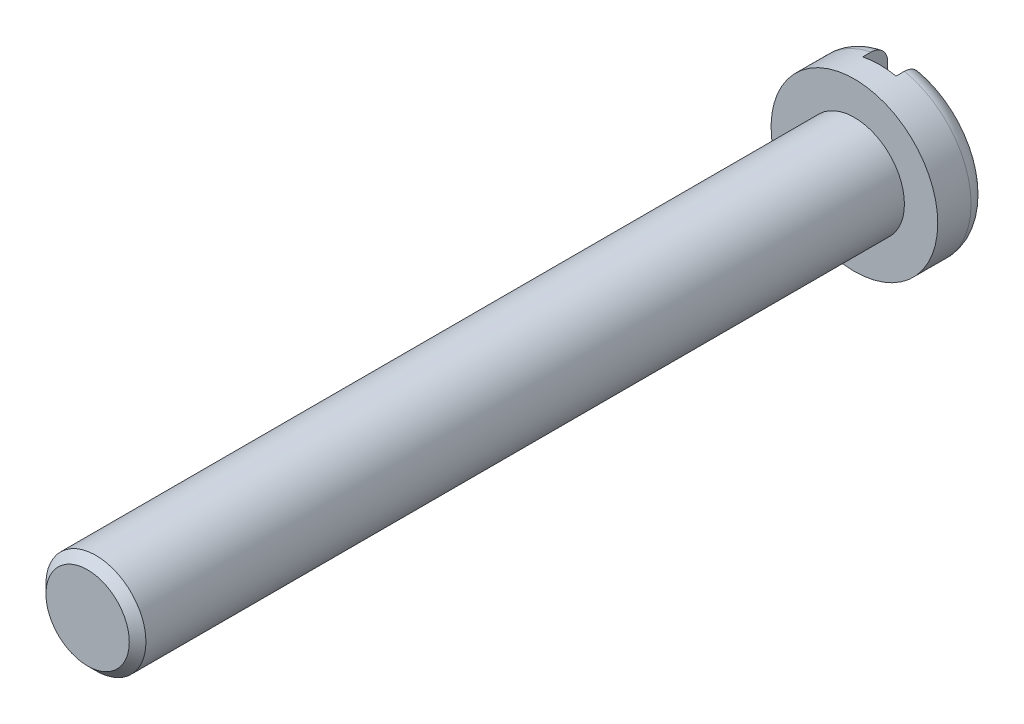
ISO-10303-21;
HEADER;
FILE_DESCRIPTION(('STEP AP214'),'2;1');
FILE_NAME('part.step','',(''),(''),'','','');
FILE_SCHEMA(('AUTOMOTIVE_DESIGN { 1 0 10303 214 1 1 1 1 }'));
ENDSEC;
DATA;
#1=APPLICATION_CONTEXT('core data for automotive mechanical design processes');
#2=APPLICATION_PROTOCOL_DEFINITION('international standard','automotive_design',2000,#1);
#3=PRODUCT_CONTEXT('',#1,'mechanical');
#4=PRODUCT('Part','Part','',(#3));
#5=PRODUCT_RELATED_PRODUCT_CATEGORY('part','',(#4));
#6=PRODUCT_DEFINITION_FORMATION('','',#4);
#7=PRODUCT_DEFINITION_CONTEXT('part definition',#1,'design');
#8=PRODUCT_DEFINITION('design','',#6,#7);
#9=PRODUCT_DEFINITION_SHAPE('','',#8);
#10=(LENGTH_UNIT() NAMED_UNIT(*) SI_UNIT(.MILLI.,.METRE.));
#11=(NAMED_UNIT(*) PLANE_ANGLE_UNIT() SI_UNIT($,.RADIAN.));
#12=(NAMED_UNIT(*) SI_UNIT($,.STERADIAN.) SOLID_ANGLE_UNIT());
#13=UNCERTAINTY_MEASURE_WITH_UNIT(LENGTH_MEASURE(1.E-05),#10,'distance_accuracy_value','');
#14=(GEOMETRIC_REPRESENTATION_CONTEXT(3) GLOBAL_UNCERTAINTY_ASSIGNED_CONTEXT((#13)) GLOBAL_UNIT_ASSIGNED_CONTEXT((#10,
#11,#12)) REPRESENTATION_CONTEXT('',''));
#15=CARTESIAN_POINT('',(0.,0.,0.));
#16=DIRECTION('',(0.,0.,1.));
#17=DIRECTION('',(1.,0.,0.));
#18=AXIS2_PLACEMENT_3D('',#15,#16,#17);
#19=CARTESIAN_POINT('',(0.,0.,0.));
#20=DIRECTION('',(0.,0.,1.));
#21=DIRECTION('',(1.,0.,0.));
#22=AXIS2_PLACEMENT_3D('',#19,#20,#21);
#23=PLANE('',#22);
#24=DIRECTION('',(0.,-1.,0.));
#25=VECTOR('',#24,1.);
#26=CARTESIAN_POINT('',(-0.5,0.,0.));
#27=LINE('',#26,#25);
#28=CARTESIAN_POINT('',(-0.5,1.93649167310371,0.));
#29=VERTEX_POINT('',#28);
#30=CARTESIAN_POINT('',(-0.5,-1.93649167310371,0.));
#31=VERTEX_POINT('',#30);
#32=EDGE_CURVE('E126',#29,#31,#27,.T.);
#33=ORIENTED_EDGE('',*,*,#32,.T.);
#34=CARTESIAN_POINT('',(0.,0.,0.));
#35=DIRECTION('',(0.,0.,1.));
#36=DIRECTION('',(1.,0.,0.));
#37=AXIS2_PLACEMENT_3D('',#34,#35,#36);
#38=CIRCLE('',#37,2.);
#39=EDGE_CURVE('E197',#31,#29,#38,.F.);
#40=ORIENTED_EDGE('',*,*,#39,.T.);
#41=EDGE_LOOP('',(#33,#40));
#42=FACE_BOUND('',#41,.T.);
#43=ADVANCED_FACE('F31',(#42),#23,.F.);
#44=CARTESIAN_POINT('',(0.,0.,1.5));
#45=DIRECTION('',(0.,0.,1.));
#46=DIRECTION('',(1.,0.,0.));
#47=AXIS2_PLACEMENT_3D('',#44,#45,#46);
#48=PLANE('',#47);
#49=CARTESIAN_POINT('',(0.,0.,1.5));
#50=DIRECTION('',(0.,0.,1.));
#51=DIRECTION('',(1.,0.,0.));
#52=AXIS2_PLACEMENT_3D('',#49,#50,#51);
#53=CIRCLE('',#52,2.5);
#54=CARTESIAN_POINT('',(2.5,0.,1.5));
#55=VERTEX_POINT('',#54);
#56=EDGE_CURVE('E115',#55,#55,#53,.T.);
#57=ORIENTED_EDGE('',*,*,#56,.T.);
#58=EDGE_LOOP('',(#57));
#59=FACE_BOUND('',#58,.T.);
#60=CARTESIAN_POINT('',(0.,0.,1.5));
#61=DIRECTION('',(0.,0.,1.));
#62=DIRECTION('',(1.,0.,0.));
#63=AXIS2_PLACEMENT_3D('',#60,#61,#62);
#64=CIRCLE('',#63,1.5);
#65=CARTESIAN_POINT('',(1.5,0.,1.5));
#66=VERTEX_POINT('',#65);
#67=EDGE_CURVE('E112',#66,#66,#64,.T.);
#68=ORIENTED_EDGE('',*,*,#67,.F.);
#69=EDGE_LOOP('',(#68));
#70=FACE_BOUND('',#69,.T.);
#71=ADVANCED_FACE('F180',(#59,#70),#48,.T.);
#72=CARTESIAN_POINT('',(0.,0.,1.5));
#73=DIRECTION('',(0.,0.,-1.));
#74=DIRECTION('',(-1.,0.,0.));
#75=AXIS2_PLACEMENT_3D('',#72,#73,#74);
#76=CYLINDRICAL_SURFACE('',#75,2.5);
#77=DIRECTION('',(0.,0.,-1.));
#78=VECTOR('',#77,1.);
#79=CARTESIAN_POINT('',(-0.5,2.44948974278318,1.5));
#80=LINE('',#79,#78);
#81=CARTESIAN_POINT('',(-0.5,2.44948974278318,0.75));
#82=VERTEX_POINT('',#81);
#83=CARTESIAN_POINT('',(-0.5,2.44948974278318,0.5));
#84=VERTEX_POINT('',#83);
#85=EDGE_CURVE('E110',#82,#84,#80,.T.);
#86=ORIENTED_EDGE('',*,*,#85,.T.);
#87=CARTESIAN_POINT('',(0.,0.,0.5));
#88=DIRECTION('',(0.,0.,1.));
#89=DIRECTION('',(1.,0.,0.));
#90=AXIS2_PLACEMENT_3D('',#87,#88,#89);
#91=CIRCLE('',#90,2.5);
#92=CARTESIAN_POINT('',(-0.5,-2.44948974278318,0.5));
#93=VERTEX_POINT('',#92);
#94=EDGE_CURVE('E130',#84,#93,#91,.T.);
#95=ORIENTED_EDGE('',*,*,#94,.T.);
#96=DIRECTION('',(0.,0.,-1.));
#97=VECTOR('',#96,1.);
#98=CARTESIAN_POINT('',(-0.5,-2.44948974278318,1.5));
#99=LINE('',#98,#97);
#100=CARTESIAN_POINT('',(-0.5,-2.44948974278318,0.75));
#101=VERTEX_POINT('',#100);
#102=EDGE_CURVE('E108',#93,#101,#99,.F.);
#103=ORIENTED_EDGE('',*,*,#102,.T.);
#104=CARTESIAN_POINT('',(0.,0.,0.75));
#105=DIRECTION('',(0.,0.,-1.));
#106=DIRECTION('',(-1.,0.,0.));
#107=AXIS2_PLACEMENT_3D('',#104,#105,#106);
#108=CIRCLE('',#107,2.5);
#109=CARTESIAN_POINT('',(0.5,-2.44948974278318,0.75));
#110=VERTEX_POINT('',#109);
#111=EDGE_CURVE('E101',#110,#101,#108,.T.);
#112=ORIENTED_EDGE('',*,*,#111,.F.);
#113=DIRECTION('',(0.,0.,-1.));
#114=VECTOR('',#113,1.);
#115=CARTESIAN_POINT('',(0.5,-2.44948974278318,1.5));
#116=LINE('',#115,#114);
#117=CARTESIAN_POINT('',(0.5,-2.44948974278318,0.5));
#118=VERTEX_POINT('',#117);
#119=EDGE_CURVE('E90',#110,#118,#116,.T.);
#120=ORIENTED_EDGE('',*,*,#119,.T.);
#121=CARTESIAN_POINT('',(0.,0.,0.5));
#122=DIRECTION('',(0.,0.,1.));
#123=DIRECTION('',(1.,0.,0.));
#124=AXIS2_PLACEMENT_3D('',#121,#122,#123);
#125=CIRCLE('',#124,2.5);
#126=CARTESIAN_POINT('',(0.5,2.44948974278318,0.5));
#127=VERTEX_POINT('',#126);
#128=EDGE_CURVE('E88',#118,#127,#125,.T.);
#129=ORIENTED_EDGE('',*,*,#128,.T.);
#130=DIRECTION('',(0.,0.,-1.));
#131=VECTOR('',#130,1.);
#132=CARTESIAN_POINT('',(0.5,2.44948974278318,1.5));
#133=LINE('',#132,#131);
#134=CARTESIAN_POINT('',(0.5,2.44948974278318,0.75));
#135=VERTEX_POINT('',#134);
#136=EDGE_CURVE('E81',#127,#135,#133,.F.);
#137=ORIENTED_EDGE('',*,*,#136,.T.);
#138=EDGE_CURVE('E85',#82,#135,#108,.T.);
#139=ORIENTED_EDGE('',*,*,#138,.F.);
#140=EDGE_LOOP('',(#86,#95,#103,#112,#120,#129,#137,#139));
#141=FACE_BOUND('',#140,.T.);
#142=ORIENTED_EDGE('',*,*,#56,.F.);
#143=EDGE_LOOP('',(#142));
#144=FACE_BOUND('',#143,.T.);
#145=ADVANCED_FACE('F33',(#141,#144),#76,.T.);
#146=DIRECTION('',(0.,1.,0.));
#147=VECTOR('',#146,1.);
#148=CARTESIAN_POINT('',(0.5,0.,0.));
#149=LINE('',#148,#147);
#150=CARTESIAN_POINT('',(0.5,-1.93649167310371,0.));
#151=VERTEX_POINT('',#150);
#152=CARTESIAN_POINT('',(0.5,1.93649167310371,0.));
#153=VERTEX_POINT('',#152);
#154=EDGE_CURVE('E124',#151,#153,#149,.T.);
#155=ORIENTED_EDGE('',*,*,#154,.T.);
#156=CARTESIAN_POINT('',(0.,0.,0.));
#157=DIRECTION('',(0.,0.,1.));
#158=DIRECTION('',(1.,0.,0.));
#159=AXIS2_PLACEMENT_3D('',#156,#157,#158);
#160=CIRCLE('',#159,2.);
#161=EDGE_CURVE('E11',#153,#151,#160,.F.);
#162=ORIENTED_EDGE('',*,*,#161,.T.);
#163=EDGE_LOOP('',(#155,#162));
#164=FACE_BOUND('',#163,.T.);
#165=ADVANCED_FACE('F183',(#164),#23,.F.);
#166=CARTESIAN_POINT('',(0.,0.,24.5));
#167=DIRECTION('',(0.,0.,-1.));
#168=DIRECTION('',(-1.,0.,0.));
#169=AXIS2_PLACEMENT_3D('',#166,#167,#168);
#170=CYLINDRICAL_SURFACE('',#169,1.5);
#171=CARTESIAN_POINT('',(0.,0.,24.25));
#172=DIRECTION('',(0.,0.,1.));
#173=DIRECTION('',(1.,0.,0.));
#174=AXIS2_PLACEMENT_3D('',#171,#172,#173);
#175=CIRCLE('',#174,1.5);
#176=CARTESIAN_POINT('',(1.5,0.,24.25));
#177=VERTEX_POINT('',#176);
#178=EDGE_CURVE('E121',#177,#177,#175,.F.);
#179=ORIENTED_EDGE('',*,*,#178,.T.);
#180=EDGE_LOOP('',(#179));
#181=FACE_BOUND('',#180,.T.);
#182=ORIENTED_EDGE('',*,*,#67,.T.);
#183=EDGE_LOOP('',(#182));
#184=FACE_BOUND('',#183,.T.);
#185=ADVANCED_FACE('F190',(#181,#184),#170,.T.);
#186=CARTESIAN_POINT('',(0.,0.,24.5));
#187=DIRECTION('',(0.,0.,1.));
#188=DIRECTION('',(1.,0.,0.));
#189=AXIS2_PLACEMENT_3D('',#186,#187,#188);
#190=PLANE('',#189);
#191=CARTESIAN_POINT('',(0.,0.,24.5));
#192=DIRECTION('',(0.,0.,1.));
#193=DIRECTION('',(1.,0.,0.));
#194=AXIS2_PLACEMENT_3D('',#191,#192,#193);
#195=CIRCLE('',#194,1.25);
#196=CARTESIAN_POINT('',(1.25,0.,24.5));
#197=VERTEX_POINT('',#196);
#198=EDGE_CURVE('E118',#197,#197,#195,.T.);
#199=ORIENTED_EDGE('',*,*,#198,.T.);
#200=EDGE_LOOP('',(#199));
#201=FACE_BOUND('',#200,.T.);
#202=ADVANCED_FACE('F195',(#201),#190,.T.);
#203=CARTESIAN_POINT('',(0.,0.,24.5));
#204=DIRECTION('',(0.,0.,-1.));
#205=DIRECTION('',(-1.,0.,0.));
#206=AXIS2_PLACEMENT_3D('',#203,#204,#205);
#207=CONICAL_SURFACE('',#206,1.25,0.785398163397457);
#208=ORIENTED_EDGE('',*,*,#178,.F.);
#209=EDGE_LOOP('',(#208));
#210=FACE_BOUND('',#209,.T.);
#211=ORIENTED_EDGE('',*,*,#198,.F.);
#212=EDGE_LOOP('',(#211));
#213=FACE_BOUND('',#212,.T.);
#214=ADVANCED_FACE('F158',(#210,#213),#207,.T.);
#215=CARTESIAN_POINT('',(0.5,3.,0.75));
#216=DIRECTION('',(0.,0.,-1.));
#217=DIRECTION('',(-1.,0.,0.));
#218=AXIS2_PLACEMENT_3D('',#215,#216,#217);
#219=PLANE('',#218);
#220=ORIENTED_EDGE('',*,*,#138,.T.);
#221=DIRECTION('',(0.,-1.,0.));
#222=VECTOR('',#221,1.);
#223=CARTESIAN_POINT('',(0.5,3.,0.75));
#224=LINE('',#223,#222);
#225=EDGE_CURVE('E98',#135,#110,#224,.T.);
#226=ORIENTED_EDGE('',*,*,#225,.T.);
#227=ORIENTED_EDGE('',*,*,#111,.T.);
#228=DIRECTION('',(0.,1.,0.));
#229=VECTOR('',#228,1.);
#230=CARTESIAN_POINT('',(-0.5,3.,0.75));
#231=LINE('',#230,#229);
#232=EDGE_CURVE('E91',#101,#82,#231,.T.);
#233=ORIENTED_EDGE('',*,*,#232,.T.);
#234=EDGE_LOOP('',(#220,#226,#227,#233));
#235=FACE_BOUND('',#234,.T.);
#236=ADVANCED_FACE('F96',(#235),#219,.T.);
#237=CARTESIAN_POINT('',(-0.5,3.,0.75));
#238=DIRECTION('',(-1.,0.,0.));
#239=DIRECTION('',(0.,-1.,0.));
#240=AXIS2_PLACEMENT_3D('',#237,#238,#239);
#241=PLANE('',#240);
#242=ORIENTED_EDGE('',*,*,#102,.F.);
#243=CARTESIAN_POINT('',(-0.5,-2.44948974278318,0.5));
#244=CARTESIAN_POINT('',(-0.5,-2.44951552153846,0.472307714735388));
#245=CARTESIAN_POINT('',(-0.5,-2.44714335894632,0.444625280241187));
#246=CARTESIAN_POINT('',(-0.5,-2.43779653150886,0.390083733950053));
#247=CARTESIAN_POINT('',(-0.5,-2.43082778164726,0.363223610407292));
#248=CARTESIAN_POINT('',(-0.5,-2.4124773393267,0.311046936439724));
#249=CARTESIAN_POINT('',(-0.5,-2.40109424402682,0.285730879668745));
#250=CARTESIAN_POINT('',(-0.5,-2.37427295705347,0.237351185675055));
#251=CARTESIAN_POINT('',(-0.5,-2.35883492238465,0.214287461290894));
#252=CARTESIAN_POINT('',(-0.5,-2.32423205120145,0.170863064085943));
#253=CARTESIAN_POINT('',(-0.5,-2.30503980077961,0.150524250804163));
#254=CARTESIAN_POINT('',(-0.5,-2.26356837324253,0.113281528309793));
#255=CARTESIAN_POINT('',(-0.5,-2.24128863816409,0.0963782413227231));
#256=CARTESIAN_POINT('',(-0.5,-2.19382213188022,0.0661298506799473));
#257=CARTESIAN_POINT('',(-0.5,-2.16858724560822,0.0528603517446172));
#258=CARTESIAN_POINT('',(-0.5,-2.11628628689538,0.030631511652938));
#259=CARTESIAN_POINT('',(-0.5,-2.089220445607,0.0216716275749196));
#260=CARTESIAN_POINT('',(-0.5,-2.04114472347478,0.00997790874685054));
#261=CARTESIAN_POINT('',(-0.5,-2.02037373282416,0.00623421628811856));
#262=CARTESIAN_POINT('',(-0.5,-1.97856721465118,0.00124529981433576));
#263=CARTESIAN_POINT('',(-0.5,-1.9575321623257,-3.90288041193154E-06));
#264=CARTESIAN_POINT('',(-0.5,-1.93649167310371,0.));
#265=B_SPLINE_CURVE_WITH_KNOTS('',3,(#243,#244,#245,#246,#247,#248,#249,#250,#251,#252,#253,
#254,#255,#256,#257,#258,#259,#260,#261,#262,#263,#264),.UNSPECIFIED.,.F.,.F.,(4,2,2,2,2,2,2,2,
2,2,4),(0.,0.0829607979326642,0.165815047919713,0.248695649878255,0.331573043225798,
0.415079875554043,0.498601818775367,0.583748333111494,0.668884117949756,0.732057913077433,
0.795130866058399),.UNSPECIFIED.);
#266=EDGE_CURVE('E140',#93,#31,#265,.T.);
#267=ORIENTED_EDGE('',*,*,#266,.T.);
#268=ORIENTED_EDGE('',*,*,#32,.F.);
#269=CARTESIAN_POINT('',(-0.5,1.93649167310371,0.));
#270=CARTESIAN_POINT('',(-0.5,1.96597918360173,-2.32483731630696E-05));
#271=CARTESIAN_POINT('',(-0.5,1.9954703465879,0.00244443196876756));
#272=CARTESIAN_POINT('',(-0.5,2.05364190249098,0.0122443935652408));
#273=CARTESIAN_POINT('',(-0.5,2.08232204026704,0.0195781882868342));
#274=CARTESIAN_POINT('',(-0.5,2.13806381714364,0.0390033487220014));
#275=CARTESIAN_POINT('',(-0.5,2.16512369635314,0.0510997832639482));
#276=CARTESIAN_POINT('',(-0.5,2.21675893149226,0.0797456974703796));
#277=CARTESIAN_POINT('',(-0.5,2.24133564335527,0.0962927286107971));
#278=CARTESIAN_POINT('',(-0.5,2.28680062352352,0.133043727015169));
#279=CARTESIAN_POINT('',(-0.5,2.3077510251354,0.153170793494596));
#280=CARTESIAN_POINT('',(-0.5,2.34587750994761,0.196741392835588));
#281=CARTESIAN_POINT('',(-0.5,2.3630529393663,0.22018549901633));
#282=CARTESIAN_POINT('',(-0.5,2.39269945813022,0.269100800225203));
#283=CARTESIAN_POINT('',(-0.5,2.40527436384722,0.294509185436261));
#284=CARTESIAN_POINT('',(-0.5,2.42588535087737,0.34709338886406));
#285=CARTESIAN_POINT('',(-0.5,2.43392555702902,0.37426757569946));
#286=CARTESIAN_POINT('',(-0.5,2.44286991868168,0.418050965258566));
#287=CARTESIAN_POINT('',(-0.5,2.4453512162633,0.434353865802166));
#288=CARTESIAN_POINT('',(-0.5,2.44866047557561,0.467101931846026));
#289=CARTESIAN_POINT('',(-0.5,2.44949090465551,0.483546848088405));
#290=CARTESIAN_POINT('',(-0.5,2.44948974278426,0.499999999999778));
#291=B_SPLINE_CURVE_WITH_KNOTS('',3,(#269,#270,#271,#272,#273,#274,#275,#276,#277,#278,#279,
#280,#281,#282,#283,#284,#285,#286,#287,#288,#289,#290),.UNSPECIFIED.,.F.,.F.,(4,2,2,2,2,2,2,2,
2,2,4),(0.,0.0883656037293287,0.176758703967744,0.26524613548075,0.353684984294896,
0.440413704427686,0.52715743315944,0.611801292615647,0.69636803391263,0.745764285084939,
0.79508665411261),.UNSPECIFIED.);
#292=EDGE_CURVE('E133',#29,#84,#291,.T.);
#293=ORIENTED_EDGE('',*,*,#292,.T.);
#294=ORIENTED_EDGE('',*,*,#85,.F.);
#295=ORIENTED_EDGE('',*,*,#232,.F.);
#296=EDGE_LOOP('',(#242,#267,#268,#293,#294,#295));
#297=FACE_BOUND('',#296,.T.);
#298=ADVANCED_FACE('F149',(#297),#241,.F.);
#299=CARTESIAN_POINT('',(0.5,3.,0.75));
#300=DIRECTION('',(1.,0.,0.));
#301=DIRECTION('',(0.,1.,0.));
#302=AXIS2_PLACEMENT_3D('',#299,#300,#301);
#303=PLANE('',#302);
#304=ORIENTED_EDGE('',*,*,#136,.F.);
#305=CARTESIAN_POINT('',(0.5,2.44948974278318,0.5));
#306=CARTESIAN_POINT('',(0.5,2.44951552153846,0.472307714735388));
#307=CARTESIAN_POINT('',(0.5,2.44714335894632,0.444625280241187));
#308=CARTESIAN_POINT('',(0.5,2.43779653150886,0.390083733950053));
#309=CARTESIAN_POINT('',(0.5,2.43082778164726,0.363223610407292));
#310=CARTESIAN_POINT('',(0.5,2.4124773393267,0.311046936439724));
#311=CARTESIAN_POINT('',(0.5,2.40109424402682,0.285730879668745));
#312=CARTESIAN_POINT('',(0.5,2.37427295705347,0.237351185675055));
#313=CARTESIAN_POINT('',(0.5,2.35883492238465,0.214287461290894));
#314=CARTESIAN_POINT('',(0.5,2.32423205120145,0.170863064085943));
#315=CARTESIAN_POINT('',(0.5,2.30503980077961,0.150524250804162));
#316=CARTESIAN_POINT('',(0.5,2.26356837324253,0.113281528309793));
#317=CARTESIAN_POINT('',(0.5,2.24128863816409,0.0963782413227231));
#318=CARTESIAN_POINT('',(0.5,2.19382213188022,0.0661298506799473));
#319=CARTESIAN_POINT('',(0.5,2.16858724560822,0.0528603517446172));
#320=CARTESIAN_POINT('',(0.5,2.11628628689538,0.0306315116529379));
#321=CARTESIAN_POINT('',(0.5,2.089220445607,0.0216716275749196));
#322=CARTESIAN_POINT('',(0.5,2.04114472347478,0.00997790874685052));
#323=CARTESIAN_POINT('',(0.5,2.02037373282416,0.00623421628811855));
#324=CARTESIAN_POINT('',(0.5,1.97856721465118,0.00124529981433575));
#325=CARTESIAN_POINT('',(0.5,1.9575321623257,-3.90288041193924E-06));
#326=CARTESIAN_POINT('',(0.5,1.93649167310371,0.));
#327=B_SPLINE_CURVE_WITH_KNOTS('',3,(#305,#306,#307,#308,#309,#310,#311,#312,#313,#314,#315,
#316,#317,#318,#319,#320,#321,#322,#323,#324,#325,#326),.UNSPECIFIED.,.F.,.F.,(4,2,2,2,2,2,2,2,
2,2,4),(0.,0.0829607979326642,0.165815047919713,0.248695649878255,0.331573043225798,
0.415079875554043,0.498601818775367,0.583748333111494,0.668884117949756,0.732057913077433,
0.795130866058399),.UNSPECIFIED.);
#328=EDGE_CURVE('E39',#127,#153,#327,.T.);
#329=ORIENTED_EDGE('',*,*,#328,.T.);
#330=ORIENTED_EDGE('',*,*,#154,.F.);
#331=CARTESIAN_POINT('',(0.5,-1.93649167310371,0.));
#332=CARTESIAN_POINT('',(0.5,-1.96597918360173,-2.32483731630712E-05));
#333=CARTESIAN_POINT('',(0.5,-1.9954703465879,0.00244443196876756));
#334=CARTESIAN_POINT('',(0.5,-2.05364190249098,0.0122443935652408));
#335=CARTESIAN_POINT('',(0.5,-2.08232204026704,0.0195781882868342));
#336=CARTESIAN_POINT('',(0.5,-2.13806381714364,0.0390033487220015));
#337=CARTESIAN_POINT('',(0.5,-2.16512369635314,0.0510997832639483));
#338=CARTESIAN_POINT('',(0.5,-2.21675893149226,0.0797456974703796));
#339=CARTESIAN_POINT('',(0.5,-2.24133564335527,0.0962927286107972));
#340=CARTESIAN_POINT('',(0.5,-2.28680062352352,0.133043727015169));
#341=CARTESIAN_POINT('',(0.5,-2.3077510251354,0.153170793494596));
#342=CARTESIAN_POINT('',(0.5,-2.34587750994761,0.196741392835587));
#343=CARTESIAN_POINT('',(0.5,-2.3630529393663,0.22018549901633));
#344=CARTESIAN_POINT('',(0.5,-2.39269945813022,0.269100800225203));
#345=CARTESIAN_POINT('',(0.5,-2.40527436384722,0.294509185436261));
#346=CARTESIAN_POINT('',(0.5,-2.42588535087737,0.34709338886406));
#347=CARTESIAN_POINT('',(0.5,-2.43392555702902,0.37426757569946));
#348=CARTESIAN_POINT('',(0.5,-2.44286991868168,0.418050965258566));
#349=CARTESIAN_POINT('',(0.5,-2.4453512162633,0.434353865802166));
#350=CARTESIAN_POINT('',(0.5,-2.44866047557561,0.467101931846026));
#351=CARTESIAN_POINT('',(0.5,-2.44949090465551,0.483546848088405));
#352=CARTESIAN_POINT('',(0.5,-2.44948974278426,0.499999999999778));
#353=B_SPLINE_CURVE_WITH_KNOTS('',3,(#331,#332,#333,#334,#335,#336,#337,#338,#339,#340,#341,
#342,#343,#344,#345,#346,#347,#348,#349,#350,#351,#352),.UNSPECIFIED.,.F.,.F.,(4,2,2,2,2,2,2,2,
2,2,4),(0.,0.0883656037293287,0.176758703967744,0.26524613548075,0.353684984294896,
0.440413704427686,0.52715743315944,0.611801292615647,0.69636803391263,0.745764285084939,
0.79508665411261),.UNSPECIFIED.);
#354=EDGE_CURVE('E162',#151,#118,#353,.T.);
#355=ORIENTED_EDGE('',*,*,#354,.T.);
#356=ORIENTED_EDGE('',*,*,#119,.F.);
#357=ORIENTED_EDGE('',*,*,#225,.F.);
#358=EDGE_LOOP('',(#304,#329,#330,#355,#356,#357));
#359=FACE_BOUND('',#358,.T.);
#360=ADVANCED_FACE('F103',(#359),#303,.F.);
#361=CARTESIAN_POINT('',(0.,0.,0.5));
#362=DIRECTION('',(0.,0.,1.));
#363=DIRECTION('',(1.,0.,0.));
#364=AXIS2_PLACEMENT_3D('',#361,#362,#363);
#365=TOROIDAL_SURFACE('',#364,2.,0.5);
#366=ORIENTED_EDGE('',*,*,#292,.F.);
#367=ORIENTED_EDGE('',*,*,#39,.F.);
#368=ORIENTED_EDGE('',*,*,#266,.F.);
#369=ORIENTED_EDGE('',*,*,#94,.F.);
#370=EDGE_LOOP('',(#366,#367,#368,#369));
#371=FACE_BOUND('',#370,.T.);
#372=ADVANCED_FACE('F145',(#371),#365,.T.);
#373=CARTESIAN_POINT('',(0.,0.,0.5));
#374=DIRECTION('',(0.,0.,1.));
#375=DIRECTION('',(1.,0.,0.));
#376=AXIS2_PLACEMENT_3D('',#373,#374,#375);
#377=TOROIDAL_SURFACE('',#376,2.,0.5);
#378=ORIENTED_EDGE('',*,*,#354,.F.);
#379=ORIENTED_EDGE('',*,*,#161,.F.);
#380=ORIENTED_EDGE('',*,*,#328,.F.);
#381=ORIENTED_EDGE('',*,*,#128,.F.);
#382=EDGE_LOOP('',(#378,#379,#380,#381));
#383=FACE_BOUND('',#382,.T.);
#384=ADVANCED_FACE('F169',(#383),#377,.T.);
#385=CLOSED_SHELL('',(#43,#71,#145,#165,#185,#202,#214,#236,#298,#360,#372,#384));
#386=MANIFOLD_SOLID_BREP('B2',#385);
#387=ADVANCED_BREP_SHAPE_REPRESENTATION('',(#18,#386),#14);
#388=SHAPE_DEFINITION_REPRESENTATION(#9,#387);
ENDSEC;
END-ISO-10303-21;
